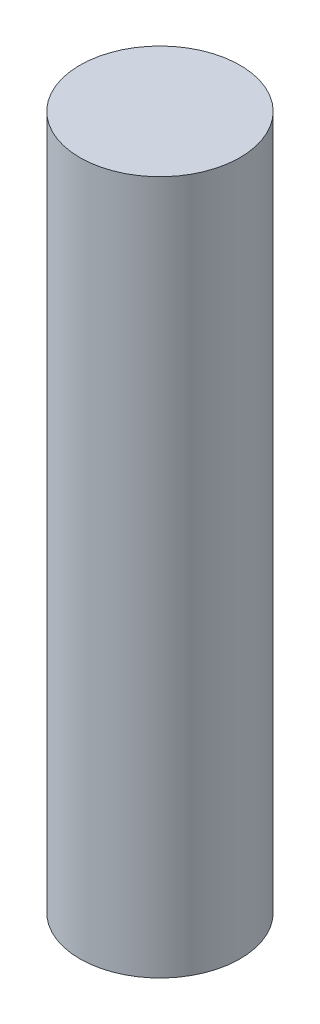
ISO-10303-21;
HEADER;
FILE_DESCRIPTION(('STEP AP214'),'2;1');
FILE_NAME('part.step','',(''),(''),'','','');
FILE_SCHEMA(('AUTOMOTIVE_DESIGN { 1 0 10303 214 1 1 1 1 }'));
ENDSEC;
DATA;
#1=APPLICATION_CONTEXT('core data for automotive mechanical design processes');
#2=APPLICATION_PROTOCOL_DEFINITION('international standard','automotive_design',2000,#1);
#3=PRODUCT_CONTEXT('',#1,'mechanical');
#4=PRODUCT('Part','Part','',(#3));
#5=PRODUCT_RELATED_PRODUCT_CATEGORY('part','',(#4));
#6=PRODUCT_DEFINITION_FORMATION('','',#4);
#7=PRODUCT_DEFINITION_CONTEXT('part definition',#1,'design');
#8=PRODUCT_DEFINITION('design','',#6,#7);
#9=PRODUCT_DEFINITION_SHAPE('','',#8);
#10=(LENGTH_UNIT() NAMED_UNIT(*) SI_UNIT(.MILLI.,.METRE.));
#11=(NAMED_UNIT(*) PLANE_ANGLE_UNIT() SI_UNIT($,.RADIAN.));
#12=(NAMED_UNIT(*) SI_UNIT($,.STERADIAN.) SOLID_ANGLE_UNIT());
#13=UNCERTAINTY_MEASURE_WITH_UNIT(LENGTH_MEASURE(1.E-05),#10,'distance_accuracy_value','');
#14=(GEOMETRIC_REPRESENTATION_CONTEXT(3) GLOBAL_UNCERTAINTY_ASSIGNED_CONTEXT((#13)) GLOBAL_UNIT_ASSIGNED_CONTEXT((#10,
#11,#12)) REPRESENTATION_CONTEXT('',''));
#15=CARTESIAN_POINT('',(0.,0.,0.));
#16=DIRECTION('',(0.,0.,1.));
#17=DIRECTION('',(1.,0.,0.));
#18=AXIS2_PLACEMENT_3D('',#15,#16,#17);
#19=CARTESIAN_POINT('',(0.,26.,0.));
#20=DIRECTION('',(0.,-1.,0.));
#21=DIRECTION('',(0.,0.,-1.));
#22=AXIS2_PLACEMENT_3D('',#19,#20,#21);
#23=CYLINDRICAL_SURFACE('',#22,3.);
#24=CARTESIAN_POINT('',(0.,26.,0.));
#25=DIRECTION('',(0.,1.,0.));
#26=DIRECTION('',(0.,0.,1.));
#27=AXIS2_PLACEMENT_3D('',#24,#25,#26);
#28=CIRCLE('',#27,3.);
#29=CARTESIAN_POINT('',(0.,26.,3.));
#30=VERTEX_POINT('',#29);
#31=EDGE_CURVE('E10',#30,#30,#28,.T.);
#32=ORIENTED_EDGE('',*,*,#31,.F.);
#33=EDGE_LOOP('',(#32));
#34=FACE_BOUND('',#33,.T.);
#35=CARTESIAN_POINT('',(0.,0.,0.));
#36=DIRECTION('',(0.,1.,0.));
#37=DIRECTION('',(0.,0.,1.));
#38=AXIS2_PLACEMENT_3D('',#35,#36,#37);
#39=CIRCLE('',#38,3.);
#40=CARTESIAN_POINT('',(0.,0.,3.));
#41=VERTEX_POINT('',#40);
#42=EDGE_CURVE('E35',#41,#41,#39,.T.);
#43=ORIENTED_EDGE('',*,*,#42,.T.);
#44=EDGE_LOOP('',(#43));
#45=FACE_BOUND('',#44,.T.);
#46=ADVANCED_FACE('F32',(#34,#45),#23,.T.);
#47=CARTESIAN_POINT('',(0.,26.,0.));
#48=DIRECTION('',(0.,1.,0.));
#49=DIRECTION('',(0.,0.,1.));
#50=AXIS2_PLACEMENT_3D('',#47,#48,#49);
#51=PLANE('',#50);
#52=ORIENTED_EDGE('',*,*,#31,.T.);
#53=EDGE_LOOP('',(#52));
#54=FACE_BOUND('',#53,.T.);
#55=ADVANCED_FACE('F47',(#54),#51,.T.);
#56=CARTESIAN_POINT('',(0.,0.,0.));
#57=DIRECTION('',(0.,1.,0.));
#58=DIRECTION('',(0.,0.,1.));
#59=AXIS2_PLACEMENT_3D('',#56,#57,#58);
#60=PLANE('',#59);
#61=ORIENTED_EDGE('',*,*,#42,.F.);
#62=EDGE_LOOP('',(#61));
#63=FACE_BOUND('',#62,.T.);
#64=ADVANCED_FACE('F45',(#63),#60,.F.);
#65=CLOSED_SHELL('',(#46,#55,#64));
#66=MANIFOLD_SOLID_BREP('B2',#65);
#67=ADVANCED_BREP_SHAPE_REPRESENTATION('',(#18,#66),#14);
#68=SHAPE_DEFINITION_REPRESENTATION(#9,#67);
ENDSEC;
END-ISO-10303-21;
